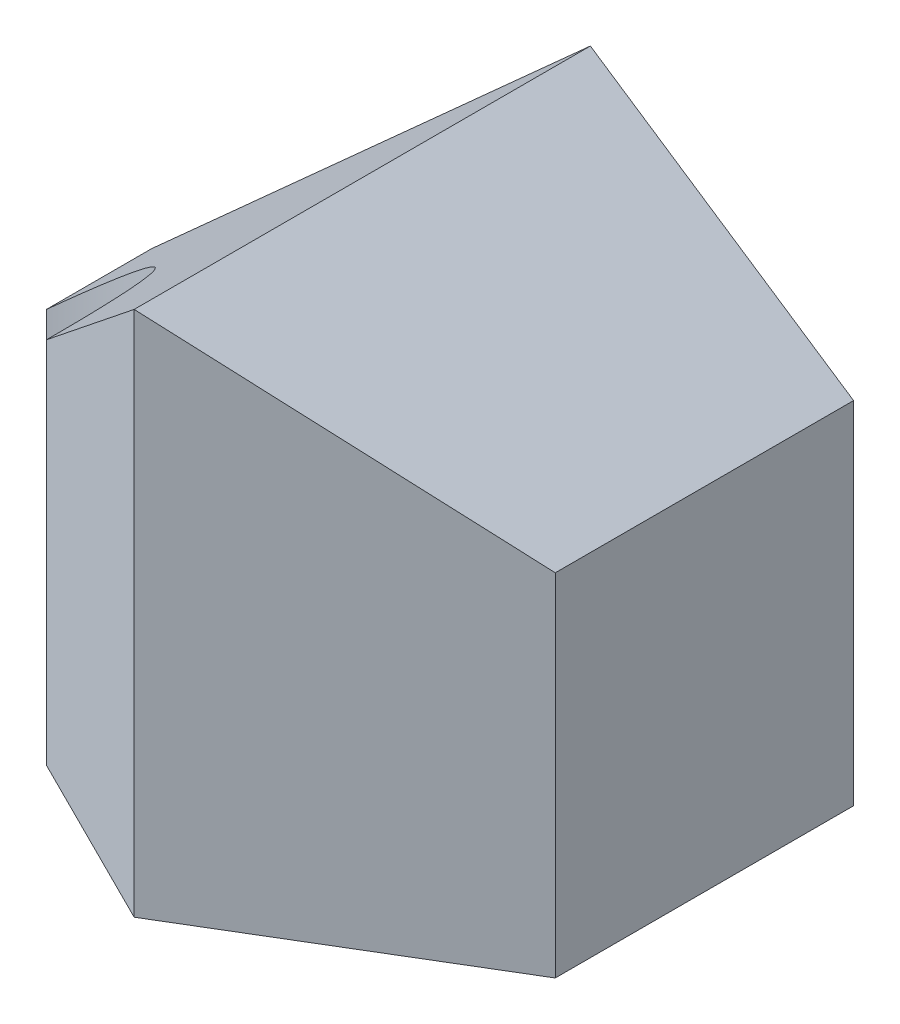
ISO-10303-21;
HEADER;
FILE_DESCRIPTION(('STEP AP214'),'2;1');
FILE_NAME('part.step','',(''),(''),'','','');
FILE_SCHEMA(('AUTOMOTIVE_DESIGN { 1 0 10303 214 1 1 1 1 }'));
ENDSEC;
DATA;
#1=APPLICATION_CONTEXT('core data for automotive mechanical design processes');
#2=APPLICATION_PROTOCOL_DEFINITION('international standard','automotive_design',2000,#1);
#3=PRODUCT_CONTEXT('',#1,'mechanical');
#4=PRODUCT('Part','Part','',(#3));
#5=PRODUCT_RELATED_PRODUCT_CATEGORY('part','',(#4));
#6=PRODUCT_DEFINITION_FORMATION('','',#4);
#7=PRODUCT_DEFINITION_CONTEXT('part definition',#1,'design');
#8=PRODUCT_DEFINITION('design','',#6,#7);
#9=PRODUCT_DEFINITION_SHAPE('','',#8);
#10=(LENGTH_UNIT() NAMED_UNIT(*) SI_UNIT(.MILLI.,.METRE.));
#11=(NAMED_UNIT(*) PLANE_ANGLE_UNIT() SI_UNIT($,.RADIAN.));
#12=(NAMED_UNIT(*) SI_UNIT($,.STERADIAN.) SOLID_ANGLE_UNIT());
#13=UNCERTAINTY_MEASURE_WITH_UNIT(LENGTH_MEASURE(1.E-05),#10,'distance_accuracy_value','');
#14=(GEOMETRIC_REPRESENTATION_CONTEXT(3) GLOBAL_UNCERTAINTY_ASSIGNED_CONTEXT((#13)) GLOBAL_UNIT_ASSIGNED_CONTEXT((#10,
#11,#12)) REPRESENTATION_CONTEXT('',''));
#15=CARTESIAN_POINT('',(0.,0.,0.));
#16=DIRECTION('',(0.,0.,1.));
#17=DIRECTION('',(1.,0.,0.));
#18=AXIS2_PLACEMENT_3D('',#15,#16,#17);
#19=CARTESIAN_POINT('',(80.,60.,-18.));
#20=DIRECTION('',(-1.,0.,0.));
#21=DIRECTION('',(0.,0.,1.));
#22=AXIS2_PLACEMENT_3D('',#19,#20,#21);
#23=PLANE('',#22);
#24=DIRECTION('',(0.,-1.,0.));
#25=VECTOR('',#24,1.);
#26=CARTESIAN_POINT('',(80.,60.,-52.));
#27=LINE('',#26,#25);
#28=CARTESIAN_POINT('',(80.,40.,-52.));
#29=VERTEX_POINT('',#28);
#30=CARTESIAN_POINT('',(80.,0.,-52.));
#31=VERTEX_POINT('',#30);
#32=EDGE_CURVE('E12',#29,#31,#27,.T.);
#33=ORIENTED_EDGE('',*,*,#32,.F.);
#34=DIRECTION('',(0.,0.,1.));
#35=VECTOR('',#34,1.);
#36=CARTESIAN_POINT('',(80.,40.,-52.));
#37=LINE('',#36,#35);
#38=CARTESIAN_POINT('',(80.,40.,-18.));
#39=VERTEX_POINT('',#38);
#40=EDGE_CURVE('E103',#29,#39,#37,.T.);
#41=ORIENTED_EDGE('',*,*,#40,.T.);
#42=DIRECTION('',(0.,-1.,0.));
#43=VECTOR('',#42,1.);
#44=CARTESIAN_POINT('',(80.,60.,-18.));
#45=LINE('',#44,#43);
#46=CARTESIAN_POINT('',(80.,0.,-18.));
#47=VERTEX_POINT('',#46);
#48=EDGE_CURVE('E62',#39,#47,#45,.T.);
#49=ORIENTED_EDGE('',*,*,#48,.T.);
#50=DIRECTION('',(0.,0.,-1.));
#51=VECTOR('',#50,1.);
#52=CARTESIAN_POINT('',(80.,0.,-18.));
#53=LINE('',#52,#51);
#54=EDGE_CURVE('E121',#47,#31,#53,.T.);
#55=ORIENTED_EDGE('',*,*,#54,.T.);
#56=EDGE_LOOP('',(#33,#41,#49,#55));
#57=FACE_BOUND('',#56,.T.);
#58=ADVANCED_FACE('F48',(#57),#23,.F.);
#59=CARTESIAN_POINT('',(0.,60.,-52.));
#60=DIRECTION('',(0.,0.,1.));
#61=DIRECTION('',(1.,0.,0.));
#62=AXIS2_PLACEMENT_3D('',#59,#60,#61);
#63=PLANE('',#62);
#64=DIRECTION('',(0.743294146247166,0.66896473162245,0.));
#65=VECTOR('',#64,1.);
#66=CARTESIAN_POINT('',(-8.48116933210634,7.36694760110429,-52.));
#67=LINE('',#66,#65);
#68=CARTESIAN_POINT('',(0.,15.,-52.));
#69=VERTEX_POINT('',#68);
#70=CARTESIAN_POINT('',(50.,60.,-52.));
#71=VERTEX_POINT('',#70);
#72=EDGE_CURVE('E118',#69,#71,#67,.T.);
#73=ORIENTED_EDGE('',*,*,#72,.T.);
#74=DIRECTION('',(0.832050294337844,-0.554700196225229,0.));
#75=VECTOR('',#74,1.);
#76=CARTESIAN_POINT('',(79.9267026978102,40.0488648681265,-52.));
#77=LINE('',#76,#75);
#78=EDGE_CURVE('E106',#71,#29,#77,.T.);
#79=ORIENTED_EDGE('',*,*,#78,.T.);
#80=ORIENTED_EDGE('',*,*,#32,.T.);
#81=DIRECTION('',(-1.,0.,0.));
#82=VECTOR('',#81,1.);
#83=CARTESIAN_POINT('',(0.,0.,-52.));
#84=LINE('',#83,#82);
#85=CARTESIAN_POINT('',(0.,0.,-52.));
#86=VERTEX_POINT('',#85);
#87=EDGE_CURVE('E124',#31,#86,#84,.T.);
#88=ORIENTED_EDGE('',*,*,#87,.T.);
#89=DIRECTION('',(0.,-1.,0.));
#90=VECTOR('',#89,1.);
#91=CARTESIAN_POINT('',(0.,60.,-52.));
#92=LINE('',#91,#90);
#93=EDGE_CURVE('E55',#69,#86,#92,.T.);
#94=ORIENTED_EDGE('',*,*,#93,.F.);
#95=EDGE_LOOP('',(#73,#79,#80,#88,#94));
#96=FACE_BOUND('',#95,.T.);
#97=ADVANCED_FACE('F114',(#96),#63,.F.);
#98=CARTESIAN_POINT('',(0.,60.,-40.));
#99=DIRECTION('',(1.,0.,0.));
#100=DIRECTION('',(0.,0.,-1.));
#101=AXIS2_PLACEMENT_3D('',#98,#99,#100);
#102=PLANE('',#101);
#103=DIRECTION('',(0.,-1.,0.));
#104=VECTOR('',#103,1.);
#105=CARTESIAN_POINT('',(0.,60.,-40.));
#106=LINE('',#105,#104);
#107=CARTESIAN_POINT('',(0.,15.,-40.));
#108=VERTEX_POINT('',#107);
#109=CARTESIAN_POINT('',(0.,0.,-40.));
#110=VERTEX_POINT('',#109);
#111=EDGE_CURVE('E147',#108,#110,#106,.T.);
#112=ORIENTED_EDGE('',*,*,#111,.F.);
#113=DIRECTION('',(0.,0.,1.));
#114=VECTOR('',#113,1.);
#115=CARTESIAN_POINT('',(0.,15.,-52.));
#116=LINE('',#115,#114);
#117=EDGE_CURVE('E154',#69,#108,#116,.T.);
#118=ORIENTED_EDGE('',*,*,#117,.F.);
#119=ORIENTED_EDGE('',*,*,#93,.T.);
#120=DIRECTION('',(0.,0.,1.));
#121=VECTOR('',#120,1.);
#122=CARTESIAN_POINT('',(0.,0.,-40.));
#123=LINE('',#122,#121);
#124=EDGE_CURVE('E127',#86,#110,#123,.T.);
#125=ORIENTED_EDGE('',*,*,#124,.T.);
#126=EDGE_LOOP('',(#112,#118,#119,#125));
#127=FACE_BOUND('',#126,.T.);
#128=ADVANCED_FACE('F151',(#127),#102,.F.);
#129=CARTESIAN_POINT('',(0.,60.,-10.));
#130=DIRECTION('',(0.,-1.,0.));
#131=DIRECTION('',(0.,0.,-1.));
#132=AXIS2_PLACEMENT_3D('',#129,#130,#131);
#133=CYLINDRICAL_SURFACE('',#132,30.);
#134=DIRECTION('',(0.,-1.,0.));
#135=VECTOR('',#134,1.);
#136=CARTESIAN_POINT('',(30.,60.,-10.));
#137=LINE('',#136,#135);
#138=CARTESIAN_POINT('',(30.,42.,-10.));
#139=VERTEX_POINT('',#138);
#140=CARTESIAN_POINT('',(30.,0.,-10.));
#141=VERTEX_POINT('',#140);
#142=EDGE_CURVE('E145',#139,#141,#137,.T.);
#143=ORIENTED_EDGE('',*,*,#142,.F.);
#144=CARTESIAN_POINT('',(0.,15.,-10.));
#145=DIRECTION('',(0.66896473162245,-0.743294146247166,0.));
#146=DIRECTION('',(-0.743294146247166,-0.66896473162245,0.));
#147=AXIS2_PLACEMENT_3D('',#144,#145,#146);
#148=ELLIPSE('',#147,40.3608721412211,30.);
#149=EDGE_CURVE('E125',#139,#108,#148,.F.);
#150=ORIENTED_EDGE('',*,*,#149,.T.);
#151=ORIENTED_EDGE('',*,*,#111,.T.);
#152=CARTESIAN_POINT('',(0.,0.,-10.));
#153=DIRECTION('',(0.,-1.,0.));
#154=DIRECTION('',(0.,0.,1.));
#155=AXIS2_PLACEMENT_3D('',#152,#153,#154);
#156=CIRCLE('',#155,30.);
#157=EDGE_CURVE('E136',#110,#141,#156,.T.);
#158=ORIENTED_EDGE('',*,*,#157,.T.);
#159=EDGE_LOOP('',(#143,#150,#151,#158));
#160=FACE_BOUND('',#159,.T.);
#161=ADVANCED_FACE('F158',(#160),#133,.F.);
#162=CARTESIAN_POINT('',(30.,60.,-10.));
#163=DIRECTION('',(0.447213595499958,0.,-0.894427190999916));
#164=DIRECTION('',(-0.894427190999916,0.,-0.447213595499958));
#165=AXIS2_PLACEMENT_3D('',#162,#163,#164);
#166=PLANE('',#165);
#167=DIRECTION('',(0.,-1.,0.));
#168=VECTOR('',#167,1.);
#169=CARTESIAN_POINT('',(50.,60.,0.));
#170=LINE('',#169,#168);
#171=CARTESIAN_POINT('',(50.,60.,0.));
#172=VERTEX_POINT('',#171);
#173=CARTESIAN_POINT('',(50.,0.,0.));
#174=VERTEX_POINT('',#173);
#175=EDGE_CURVE('E143',#172,#174,#170,.T.);
#176=ORIENTED_EDGE('',*,*,#175,.F.);
#177=DIRECTION('',(-0.696733014291618,-0.627059712862456,-0.348366507145809));
#178=VECTOR('',#177,1.);
#179=CARTESIAN_POINT('',(37.8640776699029,49.0776699029126,-6.06796116504854));
#180=LINE('',#179,#178);
#181=EDGE_CURVE('E130',#172,#139,#180,.T.);
#182=ORIENTED_EDGE('',*,*,#181,.T.);
#183=ORIENTED_EDGE('',*,*,#142,.T.);
#184=DIRECTION('',(0.894427190999916,0.,0.447213595499958));
#185=VECTOR('',#184,1.);
#186=CARTESIAN_POINT('',(30.,0.,-10.));
#187=LINE('',#186,#185);
#188=EDGE_CURVE('E70',#141,#174,#187,.T.);
#189=ORIENTED_EDGE('',*,*,#188,.T.);
#190=EDGE_LOOP('',(#176,#182,#183,#189));
#191=FACE_BOUND('',#190,.T.);
#192=ADVANCED_FACE('F163',(#191),#166,.F.);
#193=CARTESIAN_POINT('',(80.,60.,-18.));
#194=DIRECTION('',(-0.514495755427526,0.,-0.857492925712544));
#195=DIRECTION('',(-0.857492925712544,0.,0.514495755427526));
#196=AXIS2_PLACEMENT_3D('',#193,#194,#195);
#197=PLANE('',#196);
#198=ORIENTED_EDGE('',*,*,#48,.F.);
#199=DIRECTION('',(-0.744437500478198,0.496291666985465,0.446662500286919));
#200=VECTOR('',#199,1.);
#201=CARTESIAN_POINT('',(72.6108374384236,44.9261083743842,-13.5665024630542));
#202=LINE('',#201,#200);
#203=EDGE_CURVE('E109',#39,#172,#202,.T.);
#204=ORIENTED_EDGE('',*,*,#203,.T.);
#205=ORIENTED_EDGE('',*,*,#175,.T.);
#206=DIRECTION('',(0.857492925712544,0.,-0.514495755427526));
#207=VECTOR('',#206,1.);
#208=CARTESIAN_POINT('',(80.,0.,-18.));
#209=LINE('',#208,#207);
#210=EDGE_CURVE('E140',#174,#47,#209,.T.);
#211=ORIENTED_EDGE('',*,*,#210,.T.);
#212=EDGE_LOOP('',(#198,#204,#205,#211));
#213=FACE_BOUND('',#212,.T.);
#214=ADVANCED_FACE('F170',(#213),#197,.F.);
#215=CARTESIAN_POINT('',(0.,0.,-10.));
#216=DIRECTION('',(0.,1.,0.));
#217=DIRECTION('',(0.,0.,1.));
#218=AXIS2_PLACEMENT_3D('',#215,#216,#217);
#219=PLANE('',#218);
#220=ORIENTED_EDGE('',*,*,#54,.F.);
#221=ORIENTED_EDGE('',*,*,#210,.F.);
#222=ORIENTED_EDGE('',*,*,#188,.F.);
#223=ORIENTED_EDGE('',*,*,#157,.F.);
#224=ORIENTED_EDGE('',*,*,#124,.F.);
#225=ORIENTED_EDGE('',*,*,#87,.F.);
#226=EDGE_LOOP('',(#220,#221,#222,#223,#224,#225));
#227=FACE_BOUND('',#226,.T.);
#228=ADVANCED_FACE('F155',(#227),#219,.F.);
#229=CARTESIAN_POINT('',(-8.48116933210634,7.36694760110429,-52.));
#230=DIRECTION('',(0.66896473162245,-0.743294146247166,0.));
#231=DIRECTION('',(0.743294146247166,0.66896473162245,0.));
#232=AXIS2_PLACEMENT_3D('',#229,#230,#231);
#233=PLANE('',#232);
#234=ORIENTED_EDGE('',*,*,#181,.F.);
#235=DIRECTION('',(0.,0.,1.));
#236=VECTOR('',#235,1.);
#237=CARTESIAN_POINT('',(50.,60.,-52.));
#238=LINE('',#237,#236);
#239=EDGE_CURVE('E164',#71,#172,#238,.T.);
#240=ORIENTED_EDGE('',*,*,#239,.F.);
#241=ORIENTED_EDGE('',*,*,#72,.F.);
#242=ORIENTED_EDGE('',*,*,#117,.T.);
#243=ORIENTED_EDGE('',*,*,#149,.F.);
#244=EDGE_LOOP('',(#234,#240,#241,#242,#243));
#245=FACE_BOUND('',#244,.T.);
#246=ADVANCED_FACE('F162',(#245),#233,.F.);
#247=CARTESIAN_POINT('',(79.9267026978102,40.0488648681265,-52.));
#248=DIRECTION('',(-0.554700196225229,-0.832050294337843,0.));
#249=DIRECTION('',(0.832050294337844,-0.554700196225229,0.));
#250=AXIS2_PLACEMENT_3D('',#247,#248,#249);
#251=PLANE('',#250);
#252=ORIENTED_EDGE('',*,*,#40,.F.);
#253=ORIENTED_EDGE('',*,*,#78,.F.);
#254=ORIENTED_EDGE('',*,*,#239,.T.);
#255=ORIENTED_EDGE('',*,*,#203,.F.);
#256=EDGE_LOOP('',(#252,#253,#254,#255));
#257=FACE_BOUND('',#256,.T.);
#258=ADVANCED_FACE('F105',(#257),#251,.F.);
#259=CLOSED_SHELL('',(#58,#97,#128,#161,#192,#214,#228,#246,#258));
#260=MANIFOLD_SOLID_BREP('B2',#259);
#261=ADVANCED_BREP_SHAPE_REPRESENTATION('',(#18,#260),#14);
#262=SHAPE_DEFINITION_REPRESENTATION(#9,#261);
ENDSEC;
END-ISO-10303-21;
